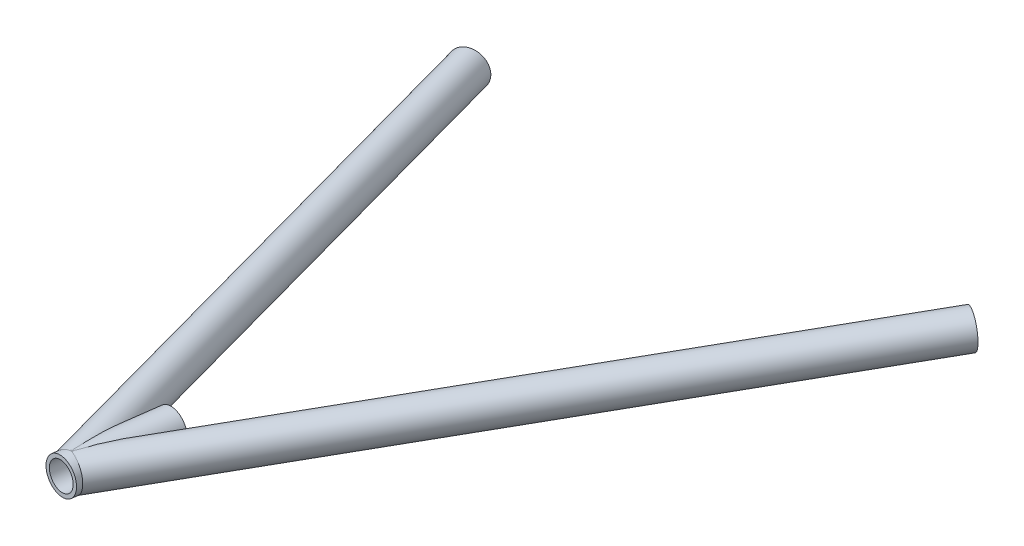
ISO-10303-21;
HEADER;
FILE_DESCRIPTION(('STEP AP214'),'2;1');
FILE_NAME('part.step','',(''),(''),'','','');
FILE_SCHEMA(('AUTOMOTIVE_DESIGN { 1 0 10303 214 1 1 1 1 }'));
ENDSEC;
DATA;
#1=APPLICATION_CONTEXT('core data for automotive mechanical design processes');
#2=APPLICATION_PROTOCOL_DEFINITION('international standard','automotive_design',2000,#1);
#3=PRODUCT_CONTEXT('',#1,'mechanical');
#4=PRODUCT('Part','Part','',(#3));
#5=PRODUCT_RELATED_PRODUCT_CATEGORY('part','',(#4));
#6=PRODUCT_DEFINITION_FORMATION('','',#4);
#7=PRODUCT_DEFINITION_CONTEXT('part definition',#1,'design');
#8=PRODUCT_DEFINITION('design','',#6,#7);
#9=PRODUCT_DEFINITION_SHAPE('','',#8);
#10=(LENGTH_UNIT() NAMED_UNIT(*) SI_UNIT(.MILLI.,.METRE.));
#11=(NAMED_UNIT(*) PLANE_ANGLE_UNIT() SI_UNIT($,.RADIAN.));
#12=(NAMED_UNIT(*) SI_UNIT($,.STERADIAN.) SOLID_ANGLE_UNIT());
#13=UNCERTAINTY_MEASURE_WITH_UNIT(LENGTH_MEASURE(1.E-05),#10,'distance_accuracy_value','');
#14=(GEOMETRIC_REPRESENTATION_CONTEXT(3) GLOBAL_UNCERTAINTY_ASSIGNED_CONTEXT((#13)) GLOBAL_UNIT_ASSIGNED_CONTEXT((#10,
#11,#12)) REPRESENTATION_CONTEXT('',''));
#15=CARTESIAN_POINT('',(0.,0.,0.));
#16=DIRECTION('',(0.,0.,1.));
#17=DIRECTION('',(1.,0.,0.));
#18=AXIS2_PLACEMENT_3D('',#15,#16,#17);
#19=CARTESIAN_POINT('',(3.75423528508109,133.137476358283,665.631869893478));
#20=DIRECTION('',(0.49375074260803,-0.000241320421330066,-0.86960344177014));
#21=DIRECTION('',(-0.869603467091057,0.,-0.493750756984952));
#22=AXIS2_PLACEMENT_3D('',#19,#20,#21);
#23=CYLINDRICAL_SURFACE('',#22,7.4168);
#24=CARTESIAN_POINT('',(182.718724008719,133.050007556528,350.436120461955));
#25=DIRECTION('',(-0.49375074260803,0.000241320421330071,0.86960344177014));
#26=DIRECTION('',(0.869603467091057,0.,0.493750756984952));
#27=AXIS2_PLACEMENT_3D('',#24,#25,#26);
#28=CIRCLE('',#27,7.4168);
#29=CARTESIAN_POINT('',(189.16839900344,133.050007556528,354.098171076361));
#30=VERTEX_POINT('',#29);
#31=EDGE_CURVE('E109',#30,#30,#28,.T.);
#32=ORIENTED_EDGE('',*,*,#31,.F.);
#33=EDGE_LOOP('',(#32));
#34=FACE_BOUND('',#33,.T.);
#35=CARTESIAN_POINT('',(17.8808395852087,133.127419712368,625.730474707942));
#36=CARTESIAN_POINT('',(17.8902756492484,133.033441099937,625.713861412463));
#37=CARTESIAN_POINT('',(17.8975971967898,132.937846745353,625.704613167863));
#38=CARTESIAN_POINT('',(17.9074973202,132.746191824254,625.702121806519));
#39=CARTESIAN_POINT('',(17.9100747188445,132.650131147951,625.708882661359));
#40=CARTESIAN_POINT('',(17.9105278099581,132.460708783187,625.737765855803));
#41=CARTESIAN_POINT('',(17.9084187404123,132.367339344448,625.759838249599));
#42=CARTESIAN_POINT('',(17.9000456186195,132.185005407172,625.817245823827));
#43=CARTESIAN_POINT('',(17.8937780961098,132.09604465441,625.852592070695));
#44=CARTESIAN_POINT('',(17.8732258774253,131.874014353576,625.957339904689));
#45=CARTESIAN_POINT('',(17.8564042754071,131.744940066849,626.034643148636));
#46=CARTESIAN_POINT('',(17.8168989728798,131.500190672569,626.206920704838));
#47=CARTESIAN_POINT('',(17.7941970852065,131.384558777849,626.301949580938));
#48=CARTESIAN_POINT('',(17.7454433154982,131.167814439191,626.501099050278));
#49=CARTESIAN_POINT('',(17.7194893664602,131.066411289716,626.604932974647));
#50=CARTESIAN_POINT('',(17.6649008274699,130.872860871437,626.820320152897));
#51=CARTESIAN_POINT('',(17.6362634944278,130.780723278227,626.931881274854));
#52=CARTESIAN_POINT('',(17.5769907633527,130.604005044662,627.160729450409));
#53=CARTESIAN_POINT('',(17.5463506242003,130.519443548459,627.278029912392));
#54=CARTESIAN_POINT('',(17.4836420610055,130.356912129069,627.516617423823));
#55=CARTESIAN_POINT('',(17.4515743324118,130.278939048851,627.637902524774));
#56=CARTESIAN_POINT('',(17.3615870226684,130.071420209845,627.976753476499));
#57=CARTESIAN_POINT('',(17.3025161882504,129.947639923559,628.19753909579));
#58=CARTESIAN_POINT('',(17.1821457717575,129.713147881691,628.645408526889));
#59=CARTESIAN_POINT('',(17.1208448286195,129.602444288118,628.872496164147));
#60=CARTESIAN_POINT('',(16.9966042333876,129.391329996882,629.331520382625));
#61=CARTESIAN_POINT('',(16.933661547833,129.290940337429,629.563465756906));
#62=CARTESIAN_POINT('',(16.8067072288981,129.098813950447,630.030630787713));
#63=CARTESIAN_POINT('',(16.7426954712505,129.007078237196,630.265850824344));
#64=CARTESIAN_POINT('',(16.6136136505078,128.830475223504,630.739925600838));
#65=CARTESIAN_POINT('',(16.5485399808433,128.745643031836,630.978792372565));
#66=CARTESIAN_POINT('',(16.4178653160346,128.582288520287,631.458534903441));
#67=CARTESIAN_POINT('',(16.3522642955801,128.503766505277,631.699410759038));
#68=CARTESIAN_POINT('',(16.2208000482123,128.352328031729,632.182473578702));
#69=CARTESIAN_POINT('',(16.1549372739287,128.279404407495,632.42465842724));
#70=CARTESIAN_POINT('',(16.0230052917129,128.13841872491,632.910376188822));
#71=CARTESIAN_POINT('',(15.9569360853337,128.070356630076,633.153909091735));
#72=CARTESIAN_POINT('',(15.8104909404638,127.924416472192,633.694608376876));
#73=CARTESIAN_POINT('',(15.730093199586,127.847574278643,633.992048301148));
#74=CARTESIAN_POINT('',(15.569338008422,127.699591553392,634.588357478155));
#75=CARTESIAN_POINT('',(15.4889805596053,127.628451216473,634.887226779348));
#76=CARTESIAN_POINT('',(15.2481834575579,127.422683573267,635.785740200492));
#77=CARTESIAN_POINT('',(15.0880360305141,127.295726228689,636.387227295318));
#78=CARTESIAN_POINT('',(14.769465248831,127.058830082422,637.594693663379));
#79=CARTESIAN_POINT('',(14.6110440060494,126.948910334559,638.200677183085));
#80=CARTESIAN_POINT('',(14.2971964198353,126.744144581536,639.415904373446));
#81=CARTESIAN_POINT('',(14.1417698718495,126.6492975436,640.025147817774));
#82=CARTESIAN_POINT('',(13.8356109366829,126.473605237434,641.244652386721));
#83=CARTESIAN_POINT('',(13.6848648232677,126.392715058237,641.854903616778));
#84=CARTESIAN_POINT('',(13.3889662914121,126.24383688354,643.078362163692));
#85=CARTESIAN_POINT('',(13.2438141318387,126.175849484563,643.691569615878));
#86=CARTESIAN_POINT('',(12.9610549558231,126.052691694737,644.920531743804));
#87=CARTESIAN_POINT('',(12.8234424659017,125.997511909338,645.536284213142));
#88=CARTESIAN_POINT('',(12.5581006723453,125.900424734636,646.770924465766));
#89=CARTESIAN_POINT('',(12.4303704311098,125.858516085034,647.389811945659));
#90=CARTESIAN_POINT('',(12.2140905809011,125.796789292402,648.498369354339));
#91=CARTESIAN_POINT('',(12.1230018790965,125.774164099645,648.987384090745));
#92=CARTESIAN_POINT('',(11.9513327278673,125.739289342594,649.967729441095));
#93=CARTESIAN_POINT('',(11.8707540011282,125.727041477439,650.459060421054));
#94=CARTESIAN_POINT('',(11.7231426612826,125.714960269534,651.444302805225));
#95=CARTESIAN_POINT('',(11.6561185239455,125.715134670582,651.938215627101));
#96=CARTESIAN_POINT('',(11.5690186332072,125.727243491945,652.680415828663));
#97=CARTESIAN_POINT('',(11.5422264903298,125.733253251557,652.92801585884));
#98=CARTESIAN_POINT('',(11.4938103428964,125.749836294096,653.423562321139));
#99=CARTESIAN_POINT('',(11.4721860647823,125.760409335386,653.671508734227));
#100=CARTESIAN_POINT('',(11.4290444115154,125.790990661345,654.245185476086));
#101=CARTESIAN_POINT('',(11.4096764493194,125.812915818618,654.570985612947));
#102=CARTESIAN_POINT('',(11.3832796911853,125.868124181302,655.222242928684));
#103=CARTESIAN_POINT('',(11.3762531519639,125.901409462664,655.547700033962));
#104=CARTESIAN_POINT('',(11.377000985245,125.982274838213,656.196261428939));
#105=CARTESIAN_POINT('',(11.3847469892731,126.029827386476,656.519369034533));
#106=CARTESIAN_POINT('',(11.417643686126,126.143193648727,657.161477881985));
#107=CARTESIAN_POINT('',(11.4427843428433,126.208996819635,657.480481383718));
#108=CARTESIAN_POINT('',(11.5001966314537,126.335940445412,657.997218996666));
#109=CARTESIAN_POINT('',(11.5266465640857,126.390237618012,658.197283045598));
#110=CARTESIAN_POINT('',(11.5880036167678,126.509785914246,658.592763002485));
#111=CARTESIAN_POINT('',(11.6229077494385,126.575033166058,658.78818052561));
#112=CARTESIAN_POINT('',(11.7011836635038,126.717857610525,659.172505134255));
#113=CARTESIAN_POINT('',(11.744546120195,126.795421207927,659.361419122066));
#114=CARTESIAN_POINT('',(11.8393085295068,126.964221209537,659.730982821725));
#115=CARTESIAN_POINT('',(11.8907082595944,127.055457235184,659.911632762208));
#116=CARTESIAN_POINT('',(12.0011160266924,127.253702919322,660.264617088224));
#117=CARTESIAN_POINT('',(12.060205412812,127.360883294599,660.436830687333));
#118=CARTESIAN_POINT('',(12.1837504491556,127.590677320362,660.768604882814));
#119=CARTESIAN_POINT('',(12.2482061663706,127.713291163524,660.928165321181));
#120=CARTESIAN_POINT('',(12.3801788932863,127.973809907857,661.232950282114));
#121=CARTESIAN_POINT('',(12.4476964254278,128.111717424453,661.378172344572));
#122=CARTESIAN_POINT('',(12.5831534786929,128.40205379099,661.653054639843));
#123=CARTESIAN_POINT('',(12.6510929618811,128.554481352685,661.782716250906));
#124=CARTESIAN_POINT('',(12.7751748394273,128.849883606177,662.008465187573));
#125=CARTESIAN_POINT('',(12.8316161640599,128.991098621851,662.106702753583));
#126=CARTESIAN_POINT('',(12.9412726602176,129.282333437735,662.29115531854));
#127=CARTESIAN_POINT('',(12.9944882102257,129.432352200913,662.37737172949));
#128=CARTESIAN_POINT('',(13.0962885268659,129.740174245292,662.537852280775));
#129=CARTESIAN_POINT('',(13.1448725892241,129.897978704885,662.612114604524));
#130=CARTESIAN_POINT('',(13.2361828958061,130.220253786529,662.748845432038));
#131=CARTESIAN_POINT('',(13.2789088548467,130.384724732611,662.811313361686));
#132=CARTESIAN_POINT('',(13.35820642468,130.722275283216,662.925720398267));
#133=CARTESIAN_POINT('',(13.3946504834968,130.895457552974,662.977444880283));
#134=CARTESIAN_POINT('',(13.459546982411,131.246364284483,663.069147074323));
#135=CARTESIAN_POINT('',(13.4879994273411,131.424088743488,663.109124793452));
#136=CARTESIAN_POINT('',(13.5362606365176,131.782906484864,663.177572209979));
#137=CARTESIAN_POINT('',(13.5560687949229,131.964000002432,663.206041100762));
#138=CARTESIAN_POINT('',(13.5865766091222,132.328367947054,663.251663362793));
#139=CARTESIAN_POINT('',(13.5972759822271,132.511642441616,663.268816382851));
#140=CARTESIAN_POINT('',(13.609579972908,132.888326312208,663.292523611119));
#141=CARTESIAN_POINT('',(13.610707053733,133.081787402882,663.298509780162));
#142=CARTESIAN_POINT('',(13.6024898877211,133.468482996136,663.298268587226));
#143=CARTESIAN_POINT('',(13.5931452937816,133.661717490992,663.292040820388));
#144=CARTESIAN_POINT('',(13.5640641940597,134.046665666074,663.267389150746));
#145=CARTESIAN_POINT('',(13.5443253484375,134.238378994006,663.248962501623));
#146=CARTESIAN_POINT('',(13.494743154922,134.618908688156,663.199856626034));
#147=CARTESIAN_POINT('',(13.4648998090722,134.807725054962,663.169177402046));
#148=CARTESIAN_POINT('',(13.3951588719526,135.183560948944,663.094963413212));
#149=CARTESIAN_POINT('',(13.355135790128,135.370525330841,663.051266933493));
#150=CARTESIAN_POINT('',(13.265988567622,135.738747203561,662.950982733271));
#151=CARTESIAN_POINT('',(13.2168642835546,135.92000460442,662.894394809665));
#152=CARTESIAN_POINT('',(13.1105283109679,136.275421665829,662.768103141341));
#153=CARTESIAN_POINT('',(13.0533175246094,136.449582115354,662.698400859424));
#154=CARTESIAN_POINT('',(12.9320810830876,136.789472842009,662.545639333686));
#155=CARTESIAN_POINT('',(12.8680556317214,136.955203371023,662.462580489264));
#156=CARTESIAN_POINT('',(12.7362703017275,137.273247890752,662.284972099191));
#157=CARTESIAN_POINT('',(12.6686292910275,137.425782011655,662.190728728829));
#158=CARTESIAN_POINT('',(12.5300275701335,137.720409182487,661.989246849203));
#159=CARTESIAN_POINT('',(12.4590669396858,137.862502483024,661.882008652012));
#160=CARTESIAN_POINT('',(12.3157894113179,138.135137845336,661.654756498028));
#161=CARTESIAN_POINT('',(12.2434735513222,138.265688341732,661.534752013552));
#162=CARTESIAN_POINT('',(12.0994740863703,138.514552882891,661.282323968567));
#163=CARTESIAN_POINT('',(12.0277904465702,138.632867605917,661.149901097222));
#164=CARTESIAN_POINT('',(11.8910784829007,138.850420302739,660.881241779546));
#165=CARTESIAN_POINT('',(11.8259032093607,138.950359373559,660.745646670171));
#166=CARTESIAN_POINT('',(11.6995013789206,139.138798444394,660.465020974085));
#167=CARTESIAN_POINT('',(11.6382745455565,139.227299245737,660.319991049418));
#168=CARTESIAN_POINT('',(11.5211031195913,139.393055692867,660.021681663506));
#169=CARTESIAN_POINT('',(11.465157144434,139.470314284808,659.868404378056));
#170=CARTESIAN_POINT('',(11.3594967538439,139.614133393912,659.554850490273));
#171=CARTESIAN_POINT('',(11.3097831794485,139.68069246756,659.394572947211));
#172=CARTESIAN_POINT('',(11.2003428375716,139.826288827693,659.00891299505));
#173=CARTESIAN_POINT('',(11.1435600376147,139.90104673391,658.781072331338));
#174=CARTESIAN_POINT('',(11.0432145600548,140.034389459542,658.31788287606));
#175=CARTESIAN_POINT('',(10.9996574289435,140.092967492624,658.08253098008));
#176=CARTESIAN_POINT('',(10.9251936446475,140.1965729234,657.606204759654));
#177=CARTESIAN_POINT('',(10.8943253079307,140.241559171035,657.365215694887));
#178=CARTESIAN_POINT('',(10.8444135795279,140.320069410752,656.880261189008));
#179=CARTESIAN_POINT('',(10.825368832679,140.353594716236,656.636296092264));
#180=CARTESIAN_POINT('',(10.7943170161128,140.418605352813,656.08396978721));
#181=CARTESIAN_POINT('',(10.7853631001404,140.447367455511,655.775123903976));
#182=CARTESIAN_POINT('',(10.7816037713285,140.493244139628,655.156425817096));
#183=CARTESIAN_POINT('',(10.7868051121615,140.510353156329,654.846573203566));
#184=CARTESIAN_POINT('',(10.8090984237159,140.535335815315,654.226406756005));
#185=CARTESIAN_POINT('',(10.8262117690693,140.543192787617,653.916093095057));
#186=CARTESIAN_POINT('',(10.8703899498514,140.551407269437,653.296156199912));
#187=CARTESIAN_POINT('',(10.8974532481907,140.551765936814,652.9865328665));
#188=CARTESIAN_POINT('',(10.9600715280981,140.546286878631,652.366615067848));
#189=CARTESIAN_POINT('',(10.9956693892169,140.540417333916,652.056325317012));
#190=CARTESIAN_POINT('',(11.0739389209607,140.523410153787,651.436788913139));
#191=CARTESIAN_POINT('',(11.1166107992238,140.512272363721,651.127542290991));
#192=CARTESIAN_POINT('',(11.2078878227765,140.485459070195,650.510445765628));
#193=CARTESIAN_POINT('',(11.2564870538899,140.469788068791,650.20259478296));
#194=CARTESIAN_POINT('',(11.3587642767749,140.434427375871,649.587967035424));
#195=CARTESIAN_POINT('',(11.4124424132728,140.414737569818,649.281190301426));
#196=CARTESIAN_POINT('',(11.5308294837275,140.369150786451,648.632032392859));
#197=CARTESIAN_POINT('',(11.5960897205968,140.342792945807,648.289784441595));
#198=CARTESIAN_POINT('',(11.7312282826813,140.285900728456,647.606554564));
#199=CARTESIAN_POINT('',(11.8011066486341,140.255366314904,647.265572648866));
#200=CARTESIAN_POINT('',(12.0166543160951,140.157892927734,646.244283527835));
#201=CARTESIAN_POINT('',(12.1682106788131,140.085093643831,645.565769579014));
#202=CARTESIAN_POINT('',(12.482358331742,139.925173184266,644.215693648317));
#203=CARTESIAN_POINT('',(12.6449072070107,139.83810539815,643.544115311846));
#204=CARTESIAN_POINT('',(12.9787741876692,139.649409283716,642.205268490085));
#205=CARTESIAN_POINT('',(13.1500913762887,139.547782475625,641.537999562408));
#206=CARTESIAN_POINT('',(13.447168155139,139.361855558334,640.407052008016));
#207=CARTESIAN_POINT('',(13.5712003062998,139.281485674074,639.942268584028));
#208=CARTESIAN_POINT('',(13.8220605444593,139.112633432841,639.014935950263));
#209=CARTESIAN_POINT('',(13.9488885941118,139.024151184179,638.552386710742));
#210=CARTESIAN_POINT('',(14.2049911017366,138.838239709357,637.629316211924));
#211=CARTESIAN_POINT('',(14.3342675958156,138.740802751571,637.168797071819));
#212=CARTESIAN_POINT('',(14.5947518205429,138.536009829626,636.250522252096));
#213=CARTESIAN_POINT('',(14.7259594861592,138.428654198839,635.792766480151));
#214=CARTESIAN_POINT('',(14.9482407630773,138.238283606942,635.024582695283));
#215=CARTESIAN_POINT('',(15.038901790926,138.158290052959,634.713285784325));
#216=CARTESIAN_POINT('',(15.2208270799683,137.992373343287,634.092456506316));
#217=CARTESIAN_POINT('',(15.312091327386,137.906450322591,633.782924099267));
#218=CARTESIAN_POINT('',(15.4950163011855,137.727987766201,633.166191940205));
#219=CARTESIAN_POINT('',(15.5866766193867,137.63545398071,632.858990411983));
#220=CARTESIAN_POINT('',(15.7703136328907,137.442712594645,632.247119331007));
#221=CARTESIAN_POINT('',(15.8622903130199,137.34250535734,631.942449659148));
#222=CARTESIAN_POINT('',(16.0801279717203,137.094786160677,631.225114215299));
#223=CARTESIAN_POINT('',(16.2060564567331,136.943394411533,630.813780007262));
#224=CARTESIAN_POINT('',(16.3947543668124,136.700007388144,630.202713044638));
#225=CARTESIAN_POINT('',(16.4576841619716,136.616069503634,629.999812782539));
#226=CARTESIAN_POINT('',(16.5833048404375,136.441890865055,629.596666924319));
#227=CARTESIAN_POINT('',(16.6459957444381,136.351650670644,629.396421094353));
#228=CARTESIAN_POINT('',(16.7712704191784,136.163278185625,628.998323938846));
#229=CARTESIAN_POINT('',(16.8338521606515,136.065109399108,628.800489148872));
#230=CARTESIAN_POINT('',(16.9583188398551,135.859739379099,628.409350113403));
#231=CARTESIAN_POINT('',(17.0202039105157,135.75253990302,628.21604499573));
#232=CARTESIAN_POINT('',(17.1427099777888,135.527246264071,627.836118042152));
#233=CARTESIAN_POINT('',(17.2033337312612,135.409179810083,627.649480805216));
#234=CARTESIAN_POINT('',(17.3227226664643,135.159037317933,627.285317600553));
#235=CARTESIAN_POINT('',(17.3814897718739,135.026976441628,627.107782075199));
#236=CARTESIAN_POINT('',(17.4834282094696,134.775214940438,626.80388732925));
#237=CARTESIAN_POINT('',(17.5272089317448,134.659085193838,626.674802701688));
#238=CARTESIAN_POINT('',(17.611729075468,134.412599192183,626.42941826928));
#239=CARTESIAN_POINT('',(17.6524684652557,134.282242789064,626.313118597521));
#240=CARTESIAN_POINT('',(17.7190876635022,134.039500137359,626.127838763741));
#241=CARTESIAN_POINT('',(17.7461171063937,133.930929340556,626.054335307472));
#242=CARTESIAN_POINT('',(17.7957600448045,133.703439838305,625.923910848911));
#243=CARTESIAN_POINT('',(17.8183899449411,133.58456206068,625.866927840177));
#244=CARTESIAN_POINT('',(17.846329216915,133.407044707398,625.801533704781));
#245=CARTESIAN_POINT('',(17.8542159738716,133.352181475292,625.783840548988));
#246=CARTESIAN_POINT('',(17.8686085663113,133.240884460612,625.75335010018));
#247=CARTESIAN_POINT('',(17.8751134147258,133.184449587777,625.740556301474));
#248=CARTESIAN_POINT('',(17.8808395852087,133.127419712368,625.730474707942));
#249=B_SPLINE_CURVE_WITH_KNOTS('',3,(#35,#36,#37,#38,#39,#40,#41,#42,#43,#44,#45,#46,#47,#48,
#49,#50,#51,#52,#53,#54,#55,#56,#57,#58,#59,#60,#61,#62,#63,#64,#65,#66,#67,#68,#69,#70,#71,#72,
#73,#74,#75,#76,#77,#78,#79,#80,#81,#82,#83,#84,#85,#86,#87,#88,#89,#90,#91,#92,#93,#94,#95,#96,
#97,#98,#99,#100,#101,#102,#103,#104,#105,#106,#107,#108,#109,#110,#111,#112,#113,#114,#115,
#116,#117,#118,#119,#120,#121,#122,#123,#124,#125,#126,#127,#128,#129,#130,#131,#132,#133,#134,
#135,#136,#137,#138,#139,#140,#141,#142,#143,#144,#145,#146,#147,#148,#149,#150,#151,#152,#153,
#154,#155,#156,#157,#158,#159,#160,#161,#162,#163,#164,#165,#166,#167,#168,#169,#170,#171,#172,
#173,#174,#175,#176,#177,#178,#179,#180,#181,#182,#183,#184,#185,#186,#187,#188,#189,#190,#191,
#192,#193,#194,#195,#196,#197,#198,#199,#200,#201,#202,#203,#204,#205,#206,#207,#208,#209,#210,
#211,#212,#213,#214,#215,#216,#217,#218,#219,#220,#221,#222,#223,#224,#225,#226,#227,#228,#229,
#230,#231,#232,#233,#234,#235,#236,#237,#238,#239,#240,#241,#242,#243,#244,#245,#246,#247,#248),
.UNSPECIFIED.,.T.,.F.,(4,2,2,2,2,2,2,2,2,2,2,2,2,2,2,2,2,2,2,2,2,2,2,2,2,2,2,2,2,2,2,2,2,2,2,2,
2,2,2,2,2,2,2,2,2,2,2,2,2,2,2,2,2,2,2,2,2,2,2,2,2,2,2,2,2,2,2,2,2,2,2,2,2,2,2,2,2,2,2,2,2,2,2,2,
2,2,2,2,2,2,2,2,2,2,2,2,2,2,2,2,2,2,2,2,2,2,4),(0.,0.287493667617879,0.575058664973744,
0.861690017430713,1.1485608674325,1.60011178645829,2.05307634187898,2.49471734309414,
2.93681484237129,3.37999970657778,3.82297098701334,4.60209329477502,5.38169936196304,
6.16286533871083,6.94412275782985,7.72913291455804,8.51418097562145,9.29820685005758,
10.0822268404569,11.0348164628127,11.9874386128639,13.8928834994701,15.8004441808667,
17.7078741006426,19.60904685706,21.5103074871329,23.4101690792358,25.3098501961042,
26.8034877348338,28.297369788189,29.7921831064909,30.5394581497208,31.286693627591,
32.267673750563,33.2488332340417,34.2281104435784,35.206823114979,35.8333420212897,
36.4596398627791,37.0852511181471,37.7108450548773,38.3436967682545,38.9765563830672,
39.6095243927435,40.242436296463,40.7849448454643,41.3273896177684,41.8699167442636,
42.4124702726045,42.9649960179228,43.5175214291157,44.0700855582345,44.6226668354236,
45.2026623849415,45.7826771600378,46.3628225575454,46.9429678377234,47.530644308164,
48.1183300380109,48.7059502550826,49.2935529039042,49.8677193817336,50.4418720735734,
51.0156016888715,51.589299483637,52.1304874373761,52.6716374566818,53.2126454048409,
53.7537262814518,54.4918002773762,55.2301833756477,55.9707800803126,56.7112918856729,
57.6415242876744,58.572200594463,59.5045512053623,60.4367578452889,61.3737500462086,
62.3107697547835,63.2468620600141,64.1829810478001,65.23114234886,66.2793128972357,
68.3760718033454,70.4651571037848,72.5540244245345,74.0171023190444,75.4801606823248,
76.9444943568768,78.4087788324419,79.4105866153407,80.4123715980399,81.4132955710035,
82.4141721882959,83.7817678138888,84.4669401760436,85.1520517707539,85.8405195621937,
86.5288536828538,87.2154788832668,87.9013676410298,88.4378942737326,88.9744264908917,
89.3750159373205,89.7740817811838,89.9484200043154,90.1228823380398),.UNSPECIFIED.);
#250=CARTESIAN_POINT('',(17.8808395852087,133.127419712368,625.730474707942));
#251=VERTEX_POINT('',#250);
#252=EDGE_CURVE('E83',#251,#251,#249,.T.);
#253=ORIENTED_EDGE('',*,*,#252,.T.);
#254=EDGE_LOOP('',(#253));
#255=FACE_BOUND('',#254,.T.);
#256=ADVANCED_FACE('F65',(#34,#255),#23,.F.);
#257=CARTESIAN_POINT('',(9.44247056550693,132.205085243907,615.965234954071));
#258=DIRECTION('',(-0.113764705608517,0.018647822287539,0.993332698788145));
#259=DIRECTION('',(0.99350545523548,0.,0.113784491110793));
#260=AXIS2_PLACEMENT_3D('',#257,#258,#259);
#261=CYLINDRICAL_SURFACE('',#260,9.52499999999999);
#262=ORIENTED_EDGE('',*,*,#252,.F.);
#263=EDGE_LOOP('',(#262));
#264=FACE_BOUND('',#263,.T.);
#265=CARTESIAN_POINT('',(3.75423528508108,133.137476358283,665.631869893478));
#266=DIRECTION('',(0.949854925607184,0.0460109181876038,0.309287270522575));
#267=DIRECTION('',(0.310022927269246,-0.0096393718602572,-0.950680212835813));
#268=AXIS2_PLACEMENT_3D('',#265,#266,#267);
#269=ELLIPSE('',#268,47.6194769568336,9.52499999999999);
#270=CARTESIAN_POINT('',(3.36599309912906,142.651945783211,665.40879016072));
#271=VERTEX_POINT('',#270);
#272=CARTESIAN_POINT('',(4.14247747103309,123.623006933356,665.854949626237));
#273=VERTEX_POINT('',#272);
#274=EDGE_CURVE('E74',#271,#273,#269,.F.);
#275=ORIENTED_EDGE('',*,*,#274,.T.);
#276=CARTESIAN_POINT('',(3.75423528508108,133.137476358283,665.631869893478));
#277=DIRECTION('',(0.310022927269246,-0.0096393718602572,-0.950680212835813));
#278=DIRECTION('',(0.949854925607184,0.0460109181876038,0.309287270522575));
#279=AXIS2_PLACEMENT_3D('',#276,#277,#278);
#280=ELLIPSE('',#279,9.72145939962004,9.52499999999999);
#281=EDGE_CURVE('E13',#273,#271,#280,.F.);
#282=ORIENTED_EDGE('',*,*,#281,.T.);
#283=EDGE_LOOP('',(#275,#282));
#284=FACE_BOUND('',#283,.T.);
#285=ADVANCED_FACE('F81',(#264,#284),#261,.F.);
#286=CARTESIAN_POINT('',(3.75423528508109,133.137476358283,665.631869893478));
#287=DIRECTION('',(0.49375074260803,-0.000241320421330066,-0.86960344177014));
#288=DIRECTION('',(-0.869603467091057,0.,-0.493750756984952));
#289=AXIS2_PLACEMENT_3D('',#286,#287,#288);
#290=CYLINDRICAL_SURFACE('',#289,9.52499999999998);
#291=CARTESIAN_POINT('',(182.718724008719,133.050007556528,350.436120461955));
#292=DIRECTION('',(-0.49375074260803,0.000241320421330071,0.86960344177014));
#293=DIRECTION('',(0.869603467091057,0.,0.493750756984952));
#294=AXIS2_PLACEMENT_3D('',#291,#292,#293);
#295=CIRCLE('',#294,9.52499999999998);
#296=CARTESIAN_POINT('',(191.001697032761,133.050007556528,355.139096422237));
#297=VERTEX_POINT('',#296);
#298=EDGE_CURVE('E69',#297,#297,#295,.T.);
#299=ORIENTED_EDGE('',*,*,#298,.T.);
#300=EDGE_LOOP('',(#299));
#301=FACE_BOUND('',#300,.T.);
#302=ORIENTED_EDGE('',*,*,#274,.F.);
#303=ORIENTED_EDGE('',*,*,#281,.F.);
#304=EDGE_LOOP('',(#302,#303));
#305=FACE_BOUND('',#304,.T.);
#306=ADVANCED_FACE('F67',(#301,#305),#290,.T.);
#307=CARTESIAN_POINT('',(182.718724008719,133.050007556528,350.436120461955));
#308=DIRECTION('',(-0.49375074260803,0.000241320421330071,0.86960344177014));
#309=DIRECTION('',(0.869603467091057,0.,0.493750756984952));
#310=AXIS2_PLACEMENT_3D('',#307,#308,#309);
#311=PLANE('',#310);
#312=ORIENTED_EDGE('',*,*,#31,.T.);
#313=EDGE_LOOP('',(#312));
#314=FACE_BOUND('',#313,.T.);
#315=ORIENTED_EDGE('',*,*,#298,.F.);
#316=EDGE_LOOP('',(#315));
#317=FACE_BOUND('',#316,.T.);
#318=ADVANCED_FACE('F86',(#314,#317),#311,.F.);
#319=CLOSED_SHELL('',(#256,#285,#306,#318));
#320=MANIFOLD_SOLID_BREP('B2',#319);
#321=CARTESIAN_POINT('',(-99.9999999999999,120.799926986381,320.));
#322=DIRECTION('',(0.28734441952249,0.0341684939690268,0.957217686103413));
#323=DIRECTION('',(0.95777694496046,0.,-0.287512301827606));
#324=AXIS2_PLACEMENT_3D('',#321,#322,#323);
#325=CYLINDRICAL_SURFACE('',#324,7.4168);
#326=CARTESIAN_POINT('',(-89.9429453167127,121.995824275297,353.50261901362));
#327=DIRECTION('',(0.28734441952249,0.0341684939690268,0.957217686103413));
#328=DIRECTION('',(0.95777694496046,0.,-0.287512301827606));
#329=AXIS2_PLACEMENT_3D('',#326,#327,#328);
#330=CIRCLE('',#329,7.4168);
#331=CARTESIAN_POINT('',(-82.8393052713299,121.995824275297,351.370197773425));
#332=VERTEX_POINT('',#331);
#333=EDGE_CURVE('E184',#332,#332,#330,.T.);
#334=ORIENTED_EDGE('',*,*,#333,.F.);
#335=EDGE_LOOP('',(#334));
#336=FACE_BOUND('',#335,.T.);
#337=CARTESIAN_POINT('',(-1.0306766814161,131.723793369787,623.895644038449));
#338=CARTESIAN_POINT('',(-1.03598895610382,131.830062972237,623.877964575296));
#339=CARTESIAN_POINT('',(-1.04072983950917,131.938149346241,623.870292940105));
#340=CARTESIAN_POINT('',(-1.04884587308507,132.153831138703,623.87589287422));
#341=CARTESIAN_POINT('',(-1.05222006787529,132.261426161913,623.889179062394));
#342=CARTESIAN_POINT('',(-1.05757505184152,132.471615671778,623.934422200887));
#343=CARTESIAN_POINT('',(-1.05956667625504,132.574243040972,623.966230288734));
#344=CARTESIAN_POINT('',(-1.06235759253172,132.773513722009,624.044879340147));
#345=CARTESIAN_POINT('',(-1.06315570631933,132.870151031216,624.091735101455));
#346=CARTESIAN_POINT('',(-1.06398902813661,133.121979227553,624.233574318152));
#347=CARTESIAN_POINT('',(-1.06310462840534,133.271029340199,624.33933861955));
#348=CARTESIAN_POINT('',(-1.05944064753744,133.552328723568,624.57118135454));
#349=CARTESIAN_POINT('',(-1.05665464458505,133.684519257573,624.697327513458));
#350=CARTESIAN_POINT('',(-1.05090921206943,133.894522830007,624.919590660995));
#351=CARTESIAN_POINT('',(-1.04829694048618,133.97610093822,625.012233839923));
#352=CARTESIAN_POINT('',(-1.04261064669264,134.133795394312,625.202065373635));
#353=CARTESIAN_POINT('',(-1.03953649743626,134.2099102309,625.299254973896));
#354=CARTESIAN_POINT('',(-1.02976512516838,134.431443571505,625.596349972568));
#355=CARTESIAN_POINT('',(-1.02252680201151,134.569794198624,625.801497689039));
#356=CARTESIAN_POINT('',(-1.00709918633588,134.83282357498,626.22171452393));
#357=CARTESIAN_POINT('',(-0.998904906545216,134.957423363817,626.436831792237));
#358=CARTESIAN_POINT('',(-0.986166234477147,135.135659593594,626.764015670469));
#359=CARTESIAN_POINT('',(-0.981847604952428,135.193602537762,626.873775601128));
#360=CARTESIAN_POINT('',(-0.973087954769081,135.306910252146,627.094612702099));
#361=CARTESIAN_POINT('',(-0.968646934919654,135.3622750394,627.2056898637));
#362=CARTESIAN_POINT('',(-0.955818466749628,135.517158274448,627.524682194557));
#363=CARTESIAN_POINT('',(-0.94731193483376,135.613835759672,627.733973771549));
#364=CARTESIAN_POINT('',(-0.930087069448808,135.800461658632,628.155540577819));
#365=CARTESIAN_POINT('',(-0.921368705408976,135.890409093383,628.36781623586));
#366=CARTESIAN_POINT('',(-0.903810152623428,136.064559634866,628.794819377207));
#367=CARTESIAN_POINT('',(-0.894969906954623,136.148759940155,629.009547997513));
#368=CARTESIAN_POINT('',(-0.877246030259563,136.312109423992,629.440920891137));
#369=CARTESIAN_POINT('',(-0.868362396845575,136.391258321098,629.657565270427));
#370=CARTESIAN_POINT('',(-0.841702391051015,136.622381363721,630.310826414527));
#371=CARTESIAN_POINT('',(-0.823956406207949,136.767651619687,630.749821832033));
#372=CARTESIAN_POINT('',(-0.788963107447627,137.043762919287,631.632164933916));
#373=CARTESIAN_POINT('',(-0.771715665164301,137.174607702092,632.075511457856));
#374=CARTESIAN_POINT('',(-0.738043366969927,137.424338782965,632.965960123924));
#375=CARTESIAN_POINT('',(-0.721619179489953,137.543215440186,633.41306498438));
#376=CARTESIAN_POINT('',(-0.689932981885975,137.770564220148,634.309968853863));
#377=CARTESIAN_POINT('',(-0.674671042566547,137.879035709106,634.75976802523));
#378=CARTESIAN_POINT('',(-0.645660069155352,138.086643107615,635.660961827187));
#379=CARTESIAN_POINT('',(-0.631909159246254,138.185790569596,636.112353744888));
#380=CARTESIAN_POINT('',(-0.606254974722383,138.375784255842,637.016918591381));
#381=CARTESIAN_POINT('',(-0.594351657268852,138.466630672557,637.470091478628));
#382=CARTESIAN_POINT('',(-0.573973662768926,138.631144062479,638.328304636324));
#383=CARTESIAN_POINT('',(-0.565266373812514,138.705603243571,638.733188002534));
#384=CARTESIAN_POINT('',(-0.549963728357252,138.848763187321,639.544016013025));
#385=CARTESIAN_POINT('',(-0.543368396631254,138.917463882425,639.949960669699));
#386=CARTESIAN_POINT('',(-0.532669234194387,139.049339808787,640.762930426574));
#387=CARTESIAN_POINT('',(-0.528566308805915,139.112513025164,641.169955865497));
#388=CARTESIAN_POINT('',(-0.523308577772878,139.233410160733,641.984833999035));
#389=CARTESIAN_POINT('',(-0.522153763844045,139.291134095238,642.392686691321));
#390=CARTESIAN_POINT('',(-0.523335722366344,139.401016208232,643.208294219255));
#391=CARTESIAN_POINT('',(-0.525665404681137,139.453185457995,643.616047569713));
#392=CARTESIAN_POINT('',(-0.534463017906564,139.551964086985,644.43217641171));
#393=CARTESIAN_POINT('',(-0.540930855481408,139.598573591584,644.84055188901));
#394=CARTESIAN_POINT('',(-0.558815590430817,139.685950276476,645.657725249953));
#395=CARTESIAN_POINT('',(-0.570231293333509,139.726718863675,646.066523007905));
#396=CARTESIAN_POINT('',(-0.599025804826678,139.801962054436,646.884476947877));
#397=CARTESIAN_POINT('',(-0.616404366004767,139.836436919048,647.293633114323));
#398=CARTESIAN_POINT('',(-0.660330001328172,139.901233484981,648.149771503553));
#399=CARTESIAN_POINT('',(-0.687573435940961,139.930881388944,648.596770943032));
#400=CARTESIAN_POINT('',(-0.752831139661977,139.980407310463,649.490607641651));
#401=CARTESIAN_POINT('',(-0.790846844642369,140.000284024618,649.937444871213));
#402=CARTESIAN_POINT('',(-0.880486782160695,140.028102715333,650.830604676185));
#403=CARTESIAN_POINT('',(-0.932122761389658,140.036034350151,651.276926471726));
#404=CARTESIAN_POINT('',(-1.02252908178519,140.036385401407,651.944612693679));
#405=CARTESIAN_POINT('',(-1.0548199533721,140.034578662222,652.166856548267));
#406=CARTESIAN_POINT('',(-1.12428546364334,140.026509644197,652.61049261359));
#407=CARTESIAN_POINT('',(-1.16145981990028,140.020247622928,652.831884872814));
#408=CARTESIAN_POINT('',(-1.2545709015963,139.999615274746,653.346865600083));
#409=CARTESIAN_POINT('',(-1.31263762531147,139.983242148889,653.640000247653));
#410=CARTESIAN_POINT('',(-1.44013648591603,139.939126401517,654.223027375331));
#411=CARTESIAN_POINT('',(-1.50957027819852,139.911382123128,654.512919376631));
#412=CARTESIAN_POINT('',(-1.66128402547727,139.84172653742,655.086986762367));
#413=CARTESIAN_POINT('',(-1.74353557007292,139.799846328428,655.371173257));
#414=CARTESIAN_POINT('',(-1.92240420675561,139.698309802539,655.931756305328));
#415=CARTESIAN_POINT('',(-2.01901374591654,139.638662815266,656.208156864371));
#416=CARTESIAN_POINT('',(-2.19327537808344,139.520391969075,656.66126739952));
#417=CARTESIAN_POINT('',(-2.2668474014411,139.467767525724,656.84111470155));
#418=CARTESIAN_POINT('',(-2.42058431136483,139.35115759139,657.194161747864));
#419=CARTESIAN_POINT('',(-2.50074694223716,139.28717597888,657.367363737042));
#420=CARTESIAN_POINT('',(-2.66698342159409,139.146627559298,657.705448839253));
#421=CARTESIAN_POINT('',(-2.75305170456787,139.070072509165,657.870339537382));
#422=CARTESIAN_POINT('',(-2.93000843045551,138.903293049835,658.190369644736));
#423=CARTESIAN_POINT('',(-3.02089678093325,138.813068902714,658.345509240836));
#424=CARTESIAN_POINT('',(-3.20662578893466,138.617429490963,658.645902289107));
#425=CARTESIAN_POINT('',(-3.30149451940569,138.511885608672,658.791054941085));
#426=CARTESIAN_POINT('',(-3.49221174028417,138.286071102502,659.068738731995));
#427=CARTESIAN_POINT('',(-3.58806025549066,138.165800105018,659.201269550579));
#428=CARTESIAN_POINT('',(-3.77830694696853,137.910874483668,659.453012620181));
#429=CARTESIAN_POINT('',(-3.87270443490035,137.776213260414,659.572218708734));
#430=CARTESIAN_POINT('',(-4.05749104433763,137.493425000322,659.796963644491));
#431=CARTESIAN_POINT('',(-4.14788040656095,137.345298773792,659.902503313199));
#432=CARTESIAN_POINT('',(-4.31216583174753,137.054741885187,660.088566325051));
#433=CARTESIAN_POINT('',(-4.38675815815442,136.91364806888,660.170571498183));
#434=CARTESIAN_POINT('',(-4.52954326315347,136.622896027954,660.324285205289));
#435=CARTESIAN_POINT('',(-4.59773665934707,136.47323863211,660.395994733316));
#436=CARTESIAN_POINT('',(-4.72649826246779,136.166406389263,660.529493977542));
#437=CARTESIAN_POINT('',(-4.78706608364938,136.009231162521,660.591283191958));
#438=CARTESIAN_POINT('',(-4.89955248842458,135.688460513062,660.705344702459));
#439=CARTESIAN_POINT('',(-4.95147062430682,135.524864758558,660.757616505932));
#440=CARTESIAN_POINT('',(-5.0475347768628,135.186355950204,660.854755050853));
#441=CARTESIAN_POINT('',(-5.09133219333104,135.011247557359,660.899285992818));
#442=CARTESIAN_POINT('',(-5.16804136329313,134.656564690267,660.978928496744));
#443=CARTESIAN_POINT('',(-5.20095297399777,134.47699015747,661.014039935148));
#444=CARTESIAN_POINT('',(-5.25537717668151,134.114569808467,661.075153454968));
#445=CARTESIAN_POINT('',(-5.27688826765889,133.931723564779,661.101154336728));
#446=CARTESIAN_POINT('',(-5.30816388780258,133.563987623375,661.144256545547));
#447=CARTESIAN_POINT('',(-5.31792809235703,133.379097869331,661.161357626662));
#448=CARTESIAN_POINT('',(-5.32570535247071,132.999915521292,661.187365194998));
#449=CARTESIAN_POINT('',(-5.32315554089905,132.805582620635,661.195857268234));
#450=CARTESIAN_POINT('',(-5.30498125669431,132.417342205469,661.203249465411));
#451=CARTESIAN_POINT('',(-5.28935636075026,132.223434704936,661.202149278788));
#452=CARTESIAN_POINT('',(-5.24519105782126,131.837353300717,661.190251882277));
#453=CARTESIAN_POINT('',(-5.21664796032934,131.645179766676,661.179452651883));
#454=CARTESIAN_POINT('',(-5.14699852088058,131.263947407094,661.147931026582));
#455=CARTESIAN_POINT('',(-5.10589221510756,131.074888572584,661.127208660255));
#456=CARTESIAN_POINT('',(-5.01124055725656,130.699520592722,661.075267338839));
#457=CARTESIAN_POINT('',(-4.95758582375108,130.513251908722,661.043954935578));
#458=CARTESIAN_POINT('',(-4.8388352944373,130.146599127699,660.970424524209));
#459=CARTESIAN_POINT('',(-4.77373934529109,129.96621510958,660.928206369935));
#460=CARTESIAN_POINT('',(-4.63315716459788,129.612713753446,660.832330370808));
#461=CARTESIAN_POINT('',(-4.55767280808205,129.439595111424,660.778674589404));
#462=CARTESIAN_POINT('',(-4.39761504625278,129.10191516164,660.659329037507));
#463=CARTESIAN_POINT('',(-4.31304196216281,128.937353551751,660.593639692258));
#464=CARTESIAN_POINT('',(-4.13884728869822,128.622461892179,660.451640851695));
#465=CARTESIAN_POINT('',(-4.04942957182437,128.471864349976,660.37567467237));
#466=CARTESIAN_POINT('',(-3.86525005108301,128.181028077293,660.211385259393));
#467=CARTESIAN_POINT('',(-3.77048841285719,128.040789026049,660.123062408626));
#468=CARTESIAN_POINT('',(-3.57765911964315,127.771691943157,659.933890571977));
#469=CARTESIAN_POINT('',(-3.47959413371849,127.642825013939,659.833051530155));
#470=CARTESIAN_POINT('',(-3.28219702268531,127.397035176557,659.618844673028));
#471=CARTESIAN_POINT('',(-3.18286496230891,127.280111660958,659.505477495508));
#472=CARTESIAN_POINT('',(-2.99078273103408,127.064985902275,659.273555240053));
#473=CARTESIAN_POINT('',(-2.89798436432277,126.966091785011,659.155680199382));
#474=CARTESIAN_POINT('',(-2.71478715635389,126.779215048255,658.909844907201));
#475=CARTESIAN_POINT('',(-2.62438845823127,126.691233078504,658.781884055894));
#476=CARTESIAN_POINT('',(-2.4474106306464,126.525889217038,658.516819482189));
#477=CARTESIAN_POINT('',(-2.36083132914819,126.448526846655,658.379716172292));
#478=CARTESIAN_POINT('',(-2.19255338035504,126.303835891383,658.097466031694));
#479=CARTESIAN_POINT('',(-2.1108554114499,126.236508699213,657.952318088359));
#480=CARTESIAN_POINT('',(-1.91903795908766,126.084074230981,657.591055505699));
#481=CARTESIAN_POINT('',(-1.81185193556309,126.00381705711,657.371325862196));
#482=CARTESIAN_POINT('',(-1.60985790031231,125.859623793161,656.92109466278));
#483=CARTESIAN_POINT('',(-1.51505601347293,125.795695764253,656.6905878527));
#484=CARTESIAN_POINT('',(-1.33741943854164,125.681348225297,656.221117646545));
#485=CARTESIAN_POINT('',(-1.25461570050639,125.630963374593,655.982134291976));
#486=CARTESIAN_POINT('',(-1.10042818801804,125.541492036485,655.498558139189));
#487=CARTESIAN_POINT('',(-1.02904247856585,125.502403633778,655.253966299482));
#488=CARTESIAN_POINT('',(-0.873788085650369,125.421610469149,654.676163697042));
#489=CARTESIAN_POINT('',(-0.794038628455963,125.383608618378,654.341337899967));
#490=CARTESIAN_POINT('',(-0.650118720714214,125.320351637771,653.667097694018));
#491=CARTESIAN_POINT('',(-0.585956615681653,125.295103328447,653.327680929336));
#492=CARTESIAN_POINT('',(-0.47050472637174,125.25457290517,652.645411673758));
#493=CARTESIAN_POINT('',(-0.419241356833427,125.239311141607,652.302553603982));
#494=CARTESIAN_POINT('',(-0.327533155094845,125.216854625957,651.615230588129));
#495=CARTESIAN_POINT('',(-0.28708639257906,125.209658433767,651.270765939937));
#496=CARTESIAN_POINT('',(-0.214828605456492,125.201888225259,650.577551489687));
#497=CARTESIAN_POINT('',(-0.183103781443576,125.201378136093,650.228792190317));
#498=CARTESIAN_POINT('',(-0.127288533058981,125.206123041942,649.530706086347));
#499=CARTESIAN_POINT('',(-0.103198356567815,125.211378224118,649.181379263691));
#500=CARTESIAN_POINT('',(-0.0614634670163922,125.226921783637,648.482953392258));
#501=CARTESIAN_POINT('',(-0.0438097727325594,125.237203100415,648.133854709841));
#502=CARTESIAN_POINT('',(-0.0139220456785875,125.262291817341,647.435597044917));
#503=CARTESIAN_POINT('',(-0.00168797777625025,125.277099188148,647.086438062816));
#504=CARTESIAN_POINT('',(0.0194058896796493,125.313018339752,646.344234721012));
#505=CARTESIAN_POINT('',(0.0276468688215875,125.334689168923,645.951200191691));
#506=CARTESIAN_POINT('',(0.0391824240005998,125.383005677036,645.165357750076));
#507=CARTESIAN_POINT('',(0.0424768475961285,125.409651509268,644.772549845138));
#508=CARTESIAN_POINT('',(0.0448511942674343,125.467744543691,643.987222001701));
#509=CARTESIAN_POINT('',(0.0439305164895254,125.499192429786,643.594702112234));
#510=CARTESIAN_POINT('',(0.0384616591790529,125.566826845933,642.81009349163));
#511=CARTESIAN_POINT('',(0.03391341571317,125.603013459491,642.418004768214));
#512=CARTESIAN_POINT('',(0.0155447946928136,125.718892782312,641.240589090844));
#513=CARTESIAN_POINT('',(-0.00300022209384826,125.805763292659,640.456029043894));
#514=CARTESIAN_POINT('',(-0.0497246311195677,125.999809357115,638.889844177398));
#515=CARTESIAN_POINT('',(-0.0779022855948665,126.106981247225,638.108218854113));
#516=CARTESIAN_POINT('',(-0.125695495862299,126.284224679428,636.94398632928));
#517=CARTESIAN_POINT('',(-0.142412715022837,126.345570966397,636.559919846295));
#518=CARTESIAN_POINT('',(-0.177533250031082,126.474378883285,635.79289267373));
#519=CARTESIAN_POINT('',(-0.195936535426566,126.541840402756,635.409931964308));
#520=CARTESIAN_POINT('',(-0.234282541581078,126.683537000908,634.645122328095));
#521=CARTESIAN_POINT('',(-0.254226099151412,126.757775765629,634.263274124282));
#522=CARTESIAN_POINT('',(-0.295513271780654,126.913803131349,633.50120190196));
#523=CARTESIAN_POINT('',(-0.316856853747245,126.995591553916,633.120977845287));
#524=CARTESIAN_POINT('',(-0.360758951085729,127.167478133462,632.363858055645));
#525=CARTESIAN_POINT('',(-0.383313020644748,127.257546646737,631.986955365448));
#526=CARTESIAN_POINT('',(-0.429611569210781,127.447617169468,631.235740727118));
#527=CARTESIAN_POINT('',(-0.453355981065567,127.547618618877,630.861428634192));
#528=CARTESIAN_POINT('',(-0.501938318552917,127.759368608359,630.116559212655));
#529=CARTESIAN_POINT('',(-0.52677525262632,127.871106619307,629.745998840091));
#530=CARTESIAN_POINT('',(-0.577493049736712,128.109054615282,629.009657513014));
#531=CARTESIAN_POINT('',(-0.603373603581148,128.235260334096,628.643875184819));
#532=CARTESIAN_POINT('',(-0.635475831155546,128.400170253136,628.202849730574));
#533=CARTESIAN_POINT('',(-0.64123209958106,128.430059111265,628.124252856039));
#534=CARTESIAN_POINT('',(-0.65279045204517,128.49077594165,627.967424179713));
#535=CARTESIAN_POINT('',(-0.658592536885737,128.521603930373,627.889192384351));
#536=CARTESIAN_POINT('',(-0.676068210122278,128.615592197133,627.655071738551));
#537=CARTESIAN_POINT('',(-0.687809331906658,128.680247131831,627.499783545675));
#538=CARTESIAN_POINT('',(-0.711548307043195,128.814583984066,627.190074920141));
#539=CARTESIAN_POINT('',(-0.723547399434397,128.884298708297,627.035668758328));
#540=CARTESIAN_POINT('',(-0.747705694425955,129.029051994185,626.729417234367));
#541=CARTESIAN_POINT('',(-0.759864861677114,129.104089395983,626.57757132319));
#542=CARTESIAN_POINT('',(-0.787270431584585,129.279213873924,626.240999795707));
#543=CARTESIAN_POINT('',(-0.80255634356423,129.380986488014,626.05714478374));
#544=CARTESIAN_POINT('',(-0.833321181385031,129.596697452397,625.696242104104));
#545=CARTESIAN_POINT('',(-0.848800362253521,129.710653814233,625.519205056118));
#546=CARTESIAN_POINT('',(-0.879662586035683,129.952791533654,625.17750356862));
#547=CARTESIAN_POINT('',(-0.895045159487666,130.08082865294,625.012738218809));
#548=CARTESIAN_POINT('',(-0.925572936537854,130.356238430974,624.700509131895));
#549=CARTESIAN_POINT('',(-0.940718819005031,130.503535936254,624.552982162587));
#550=CARTESIAN_POINT('',(-0.964502869881311,130.761309066136,624.338468238765));
#551=CARTESIAN_POINT('',(-0.973398499267803,130.864083232618,624.262359886625));
#552=CARTESIAN_POINT('',(-0.990580595466239,131.079693389178,624.126118404248));
#553=CARTESIAN_POINT('',(-0.998868900784411,131.192496511508,624.065935485584));
#554=CARTESIAN_POINT('',(-1.0110364072792,131.376293992371,623.988831532143));
#555=CARTESIAN_POINT('',(-1.01526664690593,131.444158812023,623.964475047303));
#556=CARTESIAN_POINT('',(-1.02330898077086,131.582341297749,623.923796015301));
#557=CARTESIAN_POINT('',(-1.02712083646625,131.652660333299,623.907478033011));
#558=CARTESIAN_POINT('',(-1.0306766814161,131.723793369787,623.895644038449));
#559=B_SPLINE_CURVE_WITH_KNOTS('',3,(#337,#338,#339,#340,#341,#342,#343,#344,#345,#346,#347,
#348,#349,#350,#351,#352,#353,#354,#355,#356,#357,#358,#359,#360,#361,#362,#363,#364,#365,#366,
#367,#368,#369,#370,#371,#372,#373,#374,#375,#376,#377,#378,#379,#380,#381,#382,#383,#384,#385,
#386,#387,#388,#389,#390,#391,#392,#393,#394,#395,#396,#397,#398,#399,#400,#401,#402,#403,#404,
#405,#406,#407,#408,#409,#410,#411,#412,#413,#414,#415,#416,#417,#418,#419,#420,#421,#422,#423,
#424,#425,#426,#427,#428,#429,#430,#431,#432,#433,#434,#435,#436,#437,#438,#439,#440,#441,#442,
#443,#444,#445,#446,#447,#448,#449,#450,#451,#452,#453,#454,#455,#456,#457,#458,#459,#460,#461,
#462,#463,#464,#465,#466,#467,#468,#469,#470,#471,#472,#473,#474,#475,#476,#477,#478,#479,#480,
#481,#482,#483,#484,#485,#486,#487,#488,#489,#490,#491,#492,#493,#494,#495,#496,#497,#498,#499,
#500,#501,#502,#503,#504,#505,#506,#507,#508,#509,#510,#511,#512,#513,#514,#515,#516,#517,#518,
#519,#520,#521,#522,#523,#524,#525,#526,#527,#528,#529,#530,#531,#532,#533,#534,#535,#536,#537,
#538,#539,#540,#541,#542,#543,#544,#545,#546,#547,#548,#549,#550,#551,#552,#553,#554,#555,#556,
#557,#558),.UNSPECIFIED.,.T.,.F.,(4,2,2,2,2,2,2,2,2,2,2,2,2,2,2,2,2,2,2,2,2,2,2,2,2,2,2,2,2,2,2,
2,2,2,2,2,2,2,2,2,2,2,2,2,2,2,2,2,2,2,2,2,2,2,2,2,2,2,2,2,2,2,2,2,2,2,2,2,2,2,2,2,2,2,2,2,2,2,2,
2,2,2,2,2,2,2,2,2,2,2,2,2,2,2,2,2,2,2,2,2,2,2,2,2,2,2,2,2,2,2,4),(0.,0.323255734929231,
0.646737052599498,0.967653714612628,1.28888693442391,1.8340422460376,2.38104774485595,
2.751237369497,3.12152900717099,3.863255327574,4.60904063229616,4.98158294788399,
5.35412280094921,6.046061682836,6.73810102269545,7.43047532339,8.12288816640595,
9.51078159640421,10.8983144257494,12.2869561774487,13.6756824581407,15.0626647956411,
16.4496149694036,17.6848633474275,18.9201262141465,20.1558375003214,21.3915453141123,
22.6247421692464,23.8579112106955,25.0907827165563,26.3236030739929,27.6698324604075,
29.0162413747446,30.3638153065084,31.0374877997896,31.7111213495923,32.6085831824118,
33.5061758295965,34.4018065513453,35.2969677893842,35.9004504148173,36.5037273460311,
37.106443354551,37.7091478087525,38.3172413334142,38.9253502876386,39.5337393285356,
40.1420917815085,40.6797832294635,41.2174227279048,41.755089412332,42.2927839179735,
42.8499062967704,43.4070359830577,43.9642390032833,44.5214574208279,45.1043807038799,
45.6873228600315,46.2703864829522,46.8534484265823,47.4417957944,48.0301510479918,
48.6184002467194,49.2066286617518,49.7786153527752,50.3505843240715,50.9221017428415,
51.4935900800261,52.0320015822757,52.5704451277536,53.1088643954655,53.647358317502,
54.4180307379285,55.1890828822797,55.9620898909422,56.7349657599543,57.7729894965814,
58.8115677753988,59.8522559119856,60.8927582048026,61.9432017680857,62.9936794335089,
64.0426856410205,65.0916850483525,66.2727665047781,67.45388435869,68.6351705836676,
69.8164776284525,72.1848543819333,74.5528040966956,75.7206433123358,76.8884614396628,
78.056918553048,79.2253480576075,80.3897462653885,81.5540788583158,82.7173756832581,
83.8803303553724,84.1331807176409,84.3860355156605,84.8918282414775,85.4012582459411,
85.9105775800422,86.5423294409205,87.1750284996508,87.8017626348011,88.4261204403539,
88.8097364639071,89.1921386090549,89.4083916675976,89.6247673898873),.UNSPECIFIED.);
#560=CARTESIAN_POINT('',(-1.0306766814161,131.723793369787,623.895644038449));
#561=VERTEX_POINT('',#560);
#562=EDGE_CURVE('E169',#561,#561,#559,.T.);
#563=ORIENTED_EDGE('',*,*,#562,.T.);
#564=EDGE_LOOP('',(#563));
#565=FACE_BOUND('',#564,.T.);
#566=ADVANCED_FACE('F151',(#336,#565),#325,.F.);
#567=CARTESIAN_POINT('',(-99.9999999999999,120.799926986381,320.));
#568=DIRECTION('',(0.28734441952249,0.0341684939690268,0.957217686103413));
#569=DIRECTION('',(0.95777694496046,0.,-0.287512301827606));
#570=AXIS2_PLACEMENT_3D('',#567,#568,#569);
#571=CYLINDRICAL_SURFACE('',#570,9.52499999999998);
#572=CARTESIAN_POINT('',(-89.9429453167127,121.995824275297,353.50261901362));
#573=DIRECTION('',(0.28734441952249,0.0341684939690268,0.957217686103413));
#574=DIRECTION('',(0.95777694496046,0.,-0.287512301827606));
#575=AXIS2_PLACEMENT_3D('',#572,#573,#574);
#576=CIRCLE('',#575,9.52499999999998);
#577=CARTESIAN_POINT('',(-80.8201199159643,121.995824275297,350.764064338712));
#578=VERTEX_POINT('',#577);
#579=EDGE_CURVE('E155',#578,#578,#576,.T.);
#580=ORIENTED_EDGE('',*,*,#579,.T.);
#581=EDGE_LOOP('',(#580));
#582=FACE_BOUND('',#581,.T.);
#583=CARTESIAN_POINT('',(3.75423528508107,133.137476358283,665.631869893478));
#584=DIRECTION('',(0.0886076101519195,0.0269612586344143,0.995701653084906));
#585=DIRECTION('',(0.995232277689981,0.0385099028195892,-0.0896085979626844));
#586=AXIS2_PLACEMENT_3D('',#583,#584,#585);
#587=ELLIPSE('',#586,9.72449450072625,9.52499999999999);
#588=CARTESIAN_POINT('',(3.36599309912913,142.651945783211,665.40879016072));
#589=VERTEX_POINT('',#588);
#590=CARTESIAN_POINT('',(4.14247747103301,123.623006933356,665.854949626237));
#591=VERTEX_POINT('',#590);
#592=EDGE_CURVE('E160',#589,#591,#587,.T.);
#593=ORIENTED_EDGE('',*,*,#592,.F.);
#594=CARTESIAN_POINT('',(3.75423528508107,133.137476358283,665.631869893478));
#595=DIRECTION('',(0.995232277689981,0.0385099028195892,-0.0896085979626844));
#596=DIRECTION('',(0.0886076101519195,0.0269612586344143,0.995701653084906));
#597=AXIS2_PLACEMENT_3D('',#594,#595,#596);
#598=ELLIPSE('',#597,47.2668750275922,9.52499999999999);
#599=EDGE_CURVE('E63',#591,#589,#598,.T.);
#600=ORIENTED_EDGE('',*,*,#599,.F.);
#601=EDGE_LOOP('',(#593,#600));
#602=FACE_BOUND('',#601,.T.);
#603=ADVANCED_FACE('F153',(#582,#602),#571,.T.);
#604=CARTESIAN_POINT('',(9.44247056550693,132.205085243907,615.965234954071));
#605=DIRECTION('',(-0.113764705608517,0.018647822287539,0.993332698788145));
#606=DIRECTION('',(0.99350545523548,0.,0.113784491110793));
#607=AXIS2_PLACEMENT_3D('',#604,#605,#606);
#608=CYLINDRICAL_SURFACE('',#607,9.52499999999999);
#609=ORIENTED_EDGE('',*,*,#562,.F.);
#610=EDGE_LOOP('',(#609));
#611=FACE_BOUND('',#610,.T.);
#612=ORIENTED_EDGE('',*,*,#592,.T.);
#613=ORIENTED_EDGE('',*,*,#599,.T.);
#614=EDGE_LOOP('',(#612,#613));
#615=FACE_BOUND('',#614,.T.);
#616=ADVANCED_FACE('F167',(#611,#615),#608,.F.);
#617=CARTESIAN_POINT('',(-89.9429453167127,121.995824275297,353.50261901362));
#618=DIRECTION('',(0.28734441952249,0.0341684939690268,0.957217686103413));
#619=DIRECTION('',(0.95777694496046,0.,-0.287512301827606));
#620=AXIS2_PLACEMENT_3D('',#617,#618,#619);
#621=PLANE('',#620);
#622=ORIENTED_EDGE('',*,*,#333,.T.);
#623=EDGE_LOOP('',(#622));
#624=FACE_BOUND('',#623,.T.);
#625=ORIENTED_EDGE('',*,*,#579,.F.);
#626=EDGE_LOOP('',(#625));
#627=FACE_BOUND('',#626,.T.);
#628=ADVANCED_FACE('F177',(#624,#627),#621,.F.);
#629=CLOSED_SHELL('',(#566,#603,#616,#628));
#630=MANIFOLD_SOLID_BREP('B7',#629);
#631=CARTESIAN_POINT('',(9.44247056550693,132.205085243907,615.965234954071));
#632=DIRECTION('',(-0.113764705608517,0.018647822287539,0.993332698788145));
#633=DIRECTION('',(0.99350545523548,0.,0.113784491110793));
#634=AXIS2_PLACEMENT_3D('',#631,#632,#633);
#635=CYLINDRICAL_SURFACE('',#634,7.4168);
#636=CARTESIAN_POINT('',(9.44247056550693,132.205085243907,615.965234954071));
#637=DIRECTION('',(0.113764705608517,-0.018647822287539,-0.993332698788145));
#638=DIRECTION('',(-0.99350545523548,0.,-0.113784491110793));
#639=AXIS2_PLACEMENT_3D('',#636,#637,#638);
#640=CIRCLE('',#639,7.4168);
#641=CARTESIAN_POINT('',(2.07383930511642,132.205085243907,615.121318140401));
#642=VERTEX_POINT('',#641);
#643=EDGE_CURVE('E237',#642,#642,#640,.T.);
#644=ORIENTED_EDGE('',*,*,#643,.T.);
#645=EDGE_LOOP('',(#644));
#646=FACE_BOUND('',#645,.T.);
#647=CARTESIAN_POINT('',(3.1854117570385,133.230715469721,670.598533387419));
#648=DIRECTION('',(0.113764705608517,-0.018647822287539,-0.993332698788145));
#649=DIRECTION('',(-0.99350545523548,0.,-0.113784491110793));
#650=AXIS2_PLACEMENT_3D('',#647,#648,#649);
#651=CIRCLE('',#650,7.4168);
#652=CARTESIAN_POINT('',(-4.18321950335201,133.230715469721,669.754616573749));
#653=VERTEX_POINT('',#652);
#654=EDGE_CURVE('E243',#653,#653,#651,.T.);
#655=ORIENTED_EDGE('',*,*,#654,.F.);
#656=EDGE_LOOP('',(#655));
#657=FACE_BOUND('',#656,.T.);
#658=ADVANCED_FACE('F230',(#646,#657),#635,.F.);
#659=CARTESIAN_POINT('',(9.44247056550693,132.205085243907,615.965234954071));
#660=DIRECTION('',(-0.113764705608517,0.018647822287539,0.993332698788145));
#661=DIRECTION('',(0.99350545523548,0.,0.113784491110793));
#662=AXIS2_PLACEMENT_3D('',#659,#660,#661);
#663=CYLINDRICAL_SURFACE('',#662,9.52499999999999);
#664=CARTESIAN_POINT('',(9.44247056550693,132.205085243907,615.965234954071));
#665=DIRECTION('',(0.113764705608517,-0.018647822287539,-0.993332698788145));
#666=DIRECTION('',(-0.99350545523548,0.,-0.113784491110793));
#667=AXIS2_PLACEMENT_3D('',#664,#665,#666);
#668=CIRCLE('',#667,9.52499999999999);
#669=CARTESIAN_POINT('',(-0.0206688956110122,132.205085243907,614.881437676241));
#670=VERTEX_POINT('',#669);
#671=EDGE_CURVE('E150',#670,#670,#668,.T.);
#672=ORIENTED_EDGE('',*,*,#671,.F.);
#673=EDGE_LOOP('',(#672));
#674=FACE_BOUND('',#673,.T.);
#675=CARTESIAN_POINT('',(3.1854117570385,133.230715469721,670.598533387419));
#676=DIRECTION('',(0.113764705608517,-0.018647822287539,-0.993332698788145));
#677=DIRECTION('',(-0.99350545523548,0.,-0.113784491110793));
#678=AXIS2_PLACEMENT_3D('',#675,#676,#677);
#679=CIRCLE('',#678,9.52499999999999);
#680=CARTESIAN_POINT('',(-6.27772770407944,133.230715469721,669.514736109589));
#681=VERTEX_POINT('',#680);
#682=EDGE_CURVE('E233',#681,#681,#679,.T.);
#683=ORIENTED_EDGE('',*,*,#682,.T.);
#684=EDGE_LOOP('',(#683));
#685=FACE_BOUND('',#684,.T.);
#686=ADVANCED_FACE('F250',(#674,#685),#663,.T.);
#687=CARTESIAN_POINT('',(9.44247056550693,132.205085243907,615.965234954071));
#688=DIRECTION('',(0.113764705608517,-0.018647822287539,-0.993332698788145));
#689=DIRECTION('',(-0.99350545523548,0.,-0.113784491110793));
#690=AXIS2_PLACEMENT_3D('',#687,#688,#689);
#691=PLANE('',#690);
#692=ORIENTED_EDGE('',*,*,#643,.F.);
#693=EDGE_LOOP('',(#692));
#694=FACE_BOUND('',#693,.T.);
#695=ORIENTED_EDGE('',*,*,#671,.T.);
#696=EDGE_LOOP('',(#695));
#697=FACE_BOUND('',#696,.T.);
#698=ADVANCED_FACE('F254',(#694,#697),#691,.T.);
#699=CARTESIAN_POINT('',(3.1854117570385,133.230715469721,670.598533387419));
#700=DIRECTION('',(0.113764705608517,-0.018647822287539,-0.993332698788145));
#701=DIRECTION('',(-0.99350545523548,0.,-0.113784491110793));
#702=AXIS2_PLACEMENT_3D('',#699,#700,#701);
#703=PLANE('',#702);
#704=ORIENTED_EDGE('',*,*,#654,.T.);
#705=EDGE_LOOP('',(#704));
#706=FACE_BOUND('',#705,.T.);
#707=ORIENTED_EDGE('',*,*,#682,.F.);
#708=EDGE_LOOP('',(#707));
#709=FACE_BOUND('',#708,.T.);
#710=ADVANCED_FACE('F252',(#706,#709),#703,.F.);
#711=CLOSED_SHELL('',(#658,#686,#698,#710));
#712=MANIFOLD_SOLID_BREP('B57',#711);
#713=ADVANCED_BREP_SHAPE_REPRESENTATION('',(#18,#320,#630,#712),#14);
#714=SHAPE_DEFINITION_REPRESENTATION(#9,#713);
ENDSEC;
END-ISO-10303-21;
